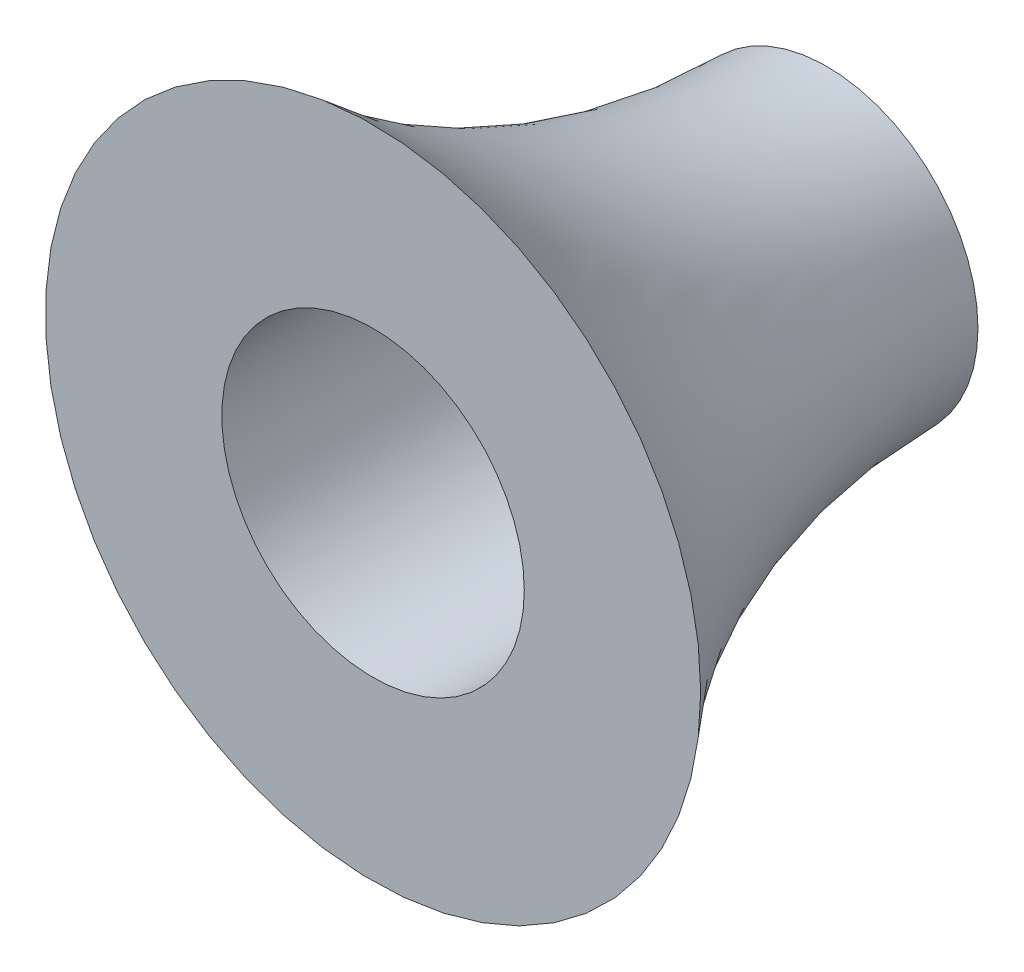
ISO-10303-21;
HEADER;
FILE_DESCRIPTION(('STEP AP214'),'2;1');
FILE_NAME('part.step','',(''),(''),'','','');
FILE_SCHEMA(('AUTOMOTIVE_DESIGN { 1 0 10303 214 1 1 1 1 }'));
ENDSEC;
DATA;
#1=APPLICATION_CONTEXT('core data for automotive mechanical design processes');
#2=APPLICATION_PROTOCOL_DEFINITION('international standard','automotive_design',2000,#1);
#3=PRODUCT_CONTEXT('',#1,'mechanical');
#4=PRODUCT('Part','Part','',(#3));
#5=PRODUCT_RELATED_PRODUCT_CATEGORY('part','',(#4));
#6=PRODUCT_DEFINITION_FORMATION('','',#4);
#7=PRODUCT_DEFINITION_CONTEXT('part definition',#1,'design');
#8=PRODUCT_DEFINITION('design','',#6,#7);
#9=PRODUCT_DEFINITION_SHAPE('','',#8);
#10=(LENGTH_UNIT() NAMED_UNIT(*) SI_UNIT(.MILLI.,.METRE.));
#11=(NAMED_UNIT(*) PLANE_ANGLE_UNIT() SI_UNIT($,.RADIAN.));
#12=(NAMED_UNIT(*) SI_UNIT($,.STERADIAN.) SOLID_ANGLE_UNIT());
#13=UNCERTAINTY_MEASURE_WITH_UNIT(LENGTH_MEASURE(1.E-05),#10,'distance_accuracy_value','');
#14=(GEOMETRIC_REPRESENTATION_CONTEXT(3) GLOBAL_UNCERTAINTY_ASSIGNED_CONTEXT((#13)) GLOBAL_UNIT_ASSIGNED_CONTEXT((#10,
#11,#12)) REPRESENTATION_CONTEXT('',''));
#15=CARTESIAN_POINT('',(0.,0.,0.));
#16=DIRECTION('',(0.,0.,1.));
#17=DIRECTION('',(1.,0.,0.));
#18=AXIS2_PLACEMENT_3D('',#15,#16,#17);
#19=CARTESIAN_POINT('',(5.24194473467972,3.31694473467972,-7.02));
#20=DIRECTION('',(0.,0.,1.));
#21=DIRECTION('',(1.,0.,0.));
#22=AXIS2_PLACEMENT_3D('',#19,#20,#21);
#23=PLANE('',#22);
#24=CARTESIAN_POINT('',(6.125,4.2,-7.02));
#25=DIRECTION('',(0.,0.,1.));
#26=DIRECTION('',(1.,0.,0.));
#27=AXIS2_PLACEMENT_3D('',#24,#25,#26);
#28=CIRCLE('',#27,0.299999999999998);
#29=CARTESIAN_POINT('',(6.425,4.2,-7.02));
#30=VERTEX_POINT('',#29);
#31=EDGE_CURVE('E19',#30,#30,#28,.T.);
#32=ORIENTED_EDGE('',*,*,#31,.F.);
#33=EDGE_LOOP('',(#32));
#34=FACE_BOUND('',#33,.T.);
#35=CARTESIAN_POINT('',(6.125,4.2,-7.01999999999981));
#36=DIRECTION('',(0.,0.,1.));
#37=DIRECTION('',(1.,0.,0.));
#38=AXIS2_PLACEMENT_3D('',#35,#36,#37);
#39=CIRCLE('',#38,0.650000000001198);
#40=CARTESIAN_POINT('',(6.7750000000012,4.2,-7.01999999999981));
#41=VERTEX_POINT('',#40);
#42=EDGE_CURVE('E23',#41,#41,#39,.F.);
#43=ORIENTED_EDGE('',*,*,#42,.F.);
#44=EDGE_LOOP('',(#43));
#45=FACE_BOUND('',#44,.T.);
#46=ADVANCED_FACE('F15',(#34,#45),#23,.T.);
#47=CARTESIAN_POINT('',(6.125,4.2,-7.92));
#48=DIRECTION('',(0.,0.,1.));
#49=DIRECTION('',(1.,0.,0.));
#50=AXIS2_PLACEMENT_3D('',#47,#48,#49);
#51=CYLINDRICAL_SURFACE('',#50,0.299999999999998);
#52=ORIENTED_EDGE('',*,*,#31,.T.);
#53=EDGE_LOOP('',(#52));
#54=FACE_BOUND('',#53,.T.);
#55=CARTESIAN_POINT('',(6.125,4.2,-7.92));
#56=DIRECTION('',(0.,0.,1.));
#57=DIRECTION('',(1.,0.,0.));
#58=AXIS2_PLACEMENT_3D('',#55,#56,#57);
#59=CIRCLE('',#58,0.299999999999998);
#60=CARTESIAN_POINT('',(6.425,4.2,-7.92));
#61=VERTEX_POINT('',#60);
#62=EDGE_CURVE('E10',#61,#61,#59,.T.);
#63=ORIENTED_EDGE('',*,*,#62,.F.);
#64=EDGE_LOOP('',(#63));
#65=FACE_BOUND('',#64,.T.);
#66=ADVANCED_FACE('F33',(#54,#65),#51,.F.);
#67=CARTESIAN_POINT('',(6.125,4.2,-7.92));
#68=DIRECTION('',(0.,0.,1.));
#69=DIRECTION('',(1.,0.,0.));
#70=AXIS2_PLACEMENT_3D('',#67,#68,#69);
#71=TOROIDAL_SURFACE('',#70,1.63214285713999,1.33214285713999);
#72=ORIENTED_EDGE('',*,*,#62,.T.);
#73=EDGE_LOOP('',(#72));
#74=FACE_BOUND('',#73,.T.);
#75=ORIENTED_EDGE('',*,*,#42,.T.);
#76=EDGE_LOOP('',(#75));
#77=FACE_BOUND('',#76,.T.);
#78=ADVANCED_FACE('F17',(#74,#77),#71,.F.);
#79=CLOSED_SHELL('',(#46,#66,#78));
#80=MANIFOLD_SOLID_BREP('B1',#79);
#81=ADVANCED_BREP_SHAPE_REPRESENTATION('',(#18,#80),#14);
#82=SHAPE_DEFINITION_REPRESENTATION(#9,#81);
ENDSEC;
END-ISO-10303-21;
